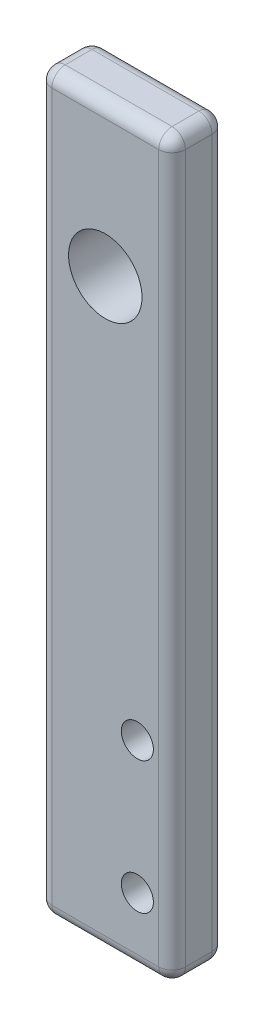
ISO-10303-21;
HEADER;
FILE_DESCRIPTION(('STEP AP214'),'2;1');
FILE_NAME('part.step','',(''),(''),'','','');
FILE_SCHEMA(('AUTOMOTIVE_DESIGN { 1 0 10303 214 1 1 1 1 }'));
ENDSEC;
DATA;
#1=APPLICATION_CONTEXT('core data for automotive mechanical design processes');
#2=APPLICATION_PROTOCOL_DEFINITION('international standard','automotive_design',2000,#1);
#3=PRODUCT_CONTEXT('',#1,'mechanical');
#4=PRODUCT('Part','Part','',(#3));
#5=PRODUCT_RELATED_PRODUCT_CATEGORY('part','',(#4));
#6=PRODUCT_DEFINITION_FORMATION('','',#4);
#7=PRODUCT_DEFINITION_CONTEXT('part definition',#1,'design');
#8=PRODUCT_DEFINITION('design','',#6,#7);
#9=PRODUCT_DEFINITION_SHAPE('','',#8);
#10=(LENGTH_UNIT() NAMED_UNIT(*) SI_UNIT(.MILLI.,.METRE.));
#11=(NAMED_UNIT(*) PLANE_ANGLE_UNIT() SI_UNIT($,.RADIAN.));
#12=(NAMED_UNIT(*) SI_UNIT($,.STERADIAN.) SOLID_ANGLE_UNIT());
#13=UNCERTAINTY_MEASURE_WITH_UNIT(LENGTH_MEASURE(1.E-05),#10,'distance_accuracy_value','');
#14=(GEOMETRIC_REPRESENTATION_CONTEXT(3) GLOBAL_UNCERTAINTY_ASSIGNED_CONTEXT((#13)) GLOBAL_UNIT_ASSIGNED_CONTEXT((#10,
#11,#12)) REPRESENTATION_CONTEXT('',''));
#15=CARTESIAN_POINT('',(0.,0.,0.));
#16=DIRECTION('',(0.,0.,1.));
#17=DIRECTION('',(1.,0.,0.));
#18=AXIS2_PLACEMENT_3D('',#15,#16,#17);
#19=CARTESIAN_POINT('',(0.,0.,4.));
#20=DIRECTION('',(0.,0.,-1.));
#21=DIRECTION('',(-1.,0.,0.));
#22=AXIS2_PLACEMENT_3D('',#19,#20,#21);
#23=PLANE('',#22);
#24=DIRECTION('',(0.,-1.,0.));
#25=VECTOR('',#24,1.);
#26=CARTESIAN_POINT('',(1.,0.,4.));
#27=LINE('',#26,#25);
#28=CARTESIAN_POINT('',(1.,54.,4.));
#29=VERTEX_POINT('',#28);
#30=CARTESIAN_POINT('',(1.,1.,4.));
#31=VERTEX_POINT('',#30);
#32=EDGE_CURVE('E144',#29,#31,#27,.T.);
#33=ORIENTED_EDGE('',*,*,#32,.T.);
#34=DIRECTION('',(1.,0.,0.));
#35=VECTOR('',#34,1.);
#36=CARTESIAN_POINT('',(0.,1.,4.));
#37=LINE('',#36,#35);
#38=CARTESIAN_POINT('',(9.,1.,4.));
#39=VERTEX_POINT('',#38);
#40=EDGE_CURVE('E139',#31,#39,#37,.T.);
#41=ORIENTED_EDGE('',*,*,#40,.T.);
#42=DIRECTION('',(0.,1.,0.));
#43=VECTOR('',#42,1.);
#44=CARTESIAN_POINT('',(9.,0.,4.));
#45=LINE('',#44,#43);
#46=CARTESIAN_POINT('',(9.,54.,4.));
#47=VERTEX_POINT('',#46);
#48=EDGE_CURVE('E133',#39,#47,#45,.T.);
#49=ORIENTED_EDGE('',*,*,#48,.T.);
#50=DIRECTION('',(-1.,0.,0.));
#51=VECTOR('',#50,1.);
#52=CARTESIAN_POINT('',(0.,54.,4.));
#53=LINE('',#52,#51);
#54=EDGE_CURVE('E136',#47,#29,#53,.T.);
#55=ORIENTED_EDGE('',*,*,#54,.T.);
#56=EDGE_LOOP('',(#33,#41,#49,#55));
#57=FACE_BOUND('',#56,.T.);
#58=CARTESIAN_POINT('',(7.3999999999983,4.99999999999631,4.));
#59=DIRECTION('',(0.,0.,1.));
#60=DIRECTION('',(1.,0.,0.));
#61=AXIS2_PLACEMENT_3D('',#58,#59,#60);
#62=CIRCLE('',#61,1.19999999998397);
#63=CARTESIAN_POINT('',(8.59999999998227,4.99999999999631,4.));
#64=VERTEX_POINT('',#63);
#65=EDGE_CURVE('E157',#64,#64,#62,.T.);
#66=ORIENTED_EDGE('',*,*,#65,.F.);
#67=EDGE_LOOP('',(#66));
#68=FACE_BOUND('',#67,.T.);
#69=CARTESIAN_POINT('',(7.39999999999826,14.8999999999963,4.));
#70=DIRECTION('',(0.,0.,1.));
#71=DIRECTION('',(1.,0.,0.));
#72=AXIS2_PLACEMENT_3D('',#69,#70,#71);
#73=CIRCLE('',#72,1.19999999998397);
#74=CARTESIAN_POINT('',(8.59999999998224,14.8999999999963,4.));
#75=VERTEX_POINT('',#74);
#76=EDGE_CURVE('E244',#75,#75,#73,.T.);
#77=ORIENTED_EDGE('',*,*,#76,.F.);
#78=EDGE_LOOP('',(#77));
#79=FACE_BOUND('',#78,.T.);
#80=CARTESIAN_POINT('',(5.00000000000172,43.7928786188915,4.));
#81=DIRECTION('',(0.,0.,1.));
#82=DIRECTION('',(1.,0.,0.));
#83=AXIS2_PLACEMENT_3D('',#80,#81,#82);
#84=CIRCLE('',#83,2.75);
#85=CARTESIAN_POINT('',(7.75000000000172,43.7928786188915,4.));
#86=VERTEX_POINT('',#85);
#87=EDGE_CURVE('E235',#86,#86,#84,.T.);
#88=ORIENTED_EDGE('',*,*,#87,.F.);
#89=EDGE_LOOP('',(#88));
#90=FACE_BOUND('',#89,.T.);
#91=ADVANCED_FACE('F40',(#57,#68,#79,#90),#23,.F.);
#92=CARTESIAN_POINT('',(0.,0.,0.));
#93=DIRECTION('',(0.,0.,-1.));
#94=DIRECTION('',(-1.,0.,0.));
#95=AXIS2_PLACEMENT_3D('',#92,#93,#94);
#96=PLANE('',#95);
#97=DIRECTION('',(0.,1.,0.));
#98=VECTOR('',#97,1.);
#99=CARTESIAN_POINT('',(9.,0.,0.));
#100=LINE('',#99,#98);
#101=CARTESIAN_POINT('',(9.,54.,0.));
#102=VERTEX_POINT('',#101);
#103=CARTESIAN_POINT('',(9.,1.,0.));
#104=VERTEX_POINT('',#103);
#105=EDGE_CURVE('E275',#102,#104,#100,.F.);
#106=ORIENTED_EDGE('',*,*,#105,.T.);
#107=DIRECTION('',(1.,0.,0.));
#108=VECTOR('',#107,1.);
#109=CARTESIAN_POINT('',(0.,1.,0.));
#110=LINE('',#109,#108);
#111=CARTESIAN_POINT('',(1.,1.,0.));
#112=VERTEX_POINT('',#111);
#113=EDGE_CURVE('E284',#104,#112,#110,.F.);
#114=ORIENTED_EDGE('',*,*,#113,.T.);
#115=DIRECTION('',(0.,-1.,0.));
#116=VECTOR('',#115,1.);
#117=CARTESIAN_POINT('',(1.,55.,0.));
#118=LINE('',#117,#116);
#119=CARTESIAN_POINT('',(1.,54.,0.));
#120=VERTEX_POINT('',#119);
#121=EDGE_CURVE('E281',#112,#120,#118,.F.);
#122=ORIENTED_EDGE('',*,*,#121,.T.);
#123=DIRECTION('',(-1.,0.,0.));
#124=VECTOR('',#123,1.);
#125=CARTESIAN_POINT('',(10.,54.,0.));
#126=LINE('',#125,#124);
#127=EDGE_CURVE('E278',#120,#102,#126,.F.);
#128=ORIENTED_EDGE('',*,*,#127,.T.);
#129=EDGE_LOOP('',(#106,#114,#122,#128));
#130=FACE_BOUND('',#129,.T.);
#131=CARTESIAN_POINT('',(7.39999999999826,14.8999999999963,0.));
#132=DIRECTION('',(0.,0.,1.));
#133=DIRECTION('',(1.,0.,0.));
#134=AXIS2_PLACEMENT_3D('',#131,#132,#133);
#135=CIRCLE('',#134,1.19999999998397);
#136=CARTESIAN_POINT('',(8.59999999998224,14.8999999999963,0.));
#137=VERTEX_POINT('',#136);
#138=EDGE_CURVE('E241',#137,#137,#135,.T.);
#139=ORIENTED_EDGE('',*,*,#138,.T.);
#140=EDGE_LOOP('',(#139));
#141=FACE_BOUND('',#140,.T.);
#142=CARTESIAN_POINT('',(7.3999999999983,4.99999999999631,0.));
#143=DIRECTION('',(0.,0.,1.));
#144=DIRECTION('',(1.,0.,0.));
#145=AXIS2_PLACEMENT_3D('',#142,#143,#144);
#146=CIRCLE('',#145,1.19999999998397);
#147=CARTESIAN_POINT('',(8.59999999998227,4.99999999999631,0.));
#148=VERTEX_POINT('',#147);
#149=EDGE_CURVE('E248',#148,#148,#146,.T.);
#150=ORIENTED_EDGE('',*,*,#149,.T.);
#151=EDGE_LOOP('',(#150));
#152=FACE_BOUND('',#151,.T.);
#153=CARTESIAN_POINT('',(5.00000000000172,43.7928786188915,0.));
#154=DIRECTION('',(0.,0.,1.));
#155=DIRECTION('',(1.,0.,0.));
#156=AXIS2_PLACEMENT_3D('',#153,#154,#155);
#157=CIRCLE('',#156,2.75);
#158=CARTESIAN_POINT('',(7.75000000000172,43.7928786188915,0.));
#159=VERTEX_POINT('',#158);
#160=EDGE_CURVE('E229',#159,#159,#157,.T.);
#161=ORIENTED_EDGE('',*,*,#160,.T.);
#162=EDGE_LOOP('',(#161));
#163=FACE_BOUND('',#162,.T.);
#164=ADVANCED_FACE('F410',(#130,#141,#152,#163),#96,.T.);
#165=CARTESIAN_POINT('',(0.,0.,4.));
#166=DIRECTION('',(1.,0.,0.));
#167=DIRECTION('',(0.,0.,-1.));
#168=AXIS2_PLACEMENT_3D('',#165,#166,#167);
#169=PLANE('',#168);
#170=DIRECTION('',(0.,0.,-1.));
#171=VECTOR('',#170,1.);
#172=CARTESIAN_POINT('',(0.,54.,4.));
#173=LINE('',#172,#171);
#174=CARTESIAN_POINT('',(0.,54.,3.));
#175=VERTEX_POINT('',#174);
#176=CARTESIAN_POINT('',(0.,54.,1.));
#177=VERTEX_POINT('',#176);
#178=EDGE_CURVE('E291',#175,#177,#173,.T.);
#179=ORIENTED_EDGE('',*,*,#178,.T.);
#180=DIRECTION('',(0.,-1.,0.));
#181=VECTOR('',#180,1.);
#182=CARTESIAN_POINT('',(0.,0.,1.));
#183=LINE('',#182,#181);
#184=CARTESIAN_POINT('',(0.,1.,1.));
#185=VERTEX_POINT('',#184);
#186=EDGE_CURVE('E298',#177,#185,#183,.T.);
#187=ORIENTED_EDGE('',*,*,#186,.T.);
#188=DIRECTION('',(0.,0.,-1.));
#189=VECTOR('',#188,1.);
#190=CARTESIAN_POINT('',(0.,1.,4.));
#191=LINE('',#190,#189);
#192=CARTESIAN_POINT('',(0.,1.,3.));
#193=VERTEX_POINT('',#192);
#194=EDGE_CURVE('E294',#185,#193,#191,.F.);
#195=ORIENTED_EDGE('',*,*,#194,.T.);
#196=DIRECTION('',(0.,-1.,0.));
#197=VECTOR('',#196,1.);
#198=CARTESIAN_POINT('',(0.,0.,3.));
#199=LINE('',#198,#197);
#200=EDGE_CURVE('E288',#193,#175,#199,.F.);
#201=ORIENTED_EDGE('',*,*,#200,.T.);
#202=EDGE_LOOP('',(#179,#187,#195,#201));
#203=FACE_BOUND('',#202,.T.);
#204=ADVANCED_FACE('F381',(#203),#169,.F.);
#205=CARTESIAN_POINT('',(0.,0.,4.));
#206=DIRECTION('',(0.,1.,0.));
#207=DIRECTION('',(0.,0.,1.));
#208=AXIS2_PLACEMENT_3D('',#205,#206,#207);
#209=PLANE('',#208);
#210=DIRECTION('',(1.,0.,0.));
#211=VECTOR('',#210,1.);
#212=CARTESIAN_POINT('',(0.,0.,3.));
#213=LINE('',#212,#211);
#214=CARTESIAN_POINT('',(9.,0.,3.));
#215=VERTEX_POINT('',#214);
#216=CARTESIAN_POINT('',(1.,0.,3.));
#217=VERTEX_POINT('',#216);
#218=EDGE_CURVE('E268',#215,#217,#213,.F.);
#219=ORIENTED_EDGE('',*,*,#218,.T.);
#220=DIRECTION('',(0.,0.,-1.));
#221=VECTOR('',#220,1.);
#222=CARTESIAN_POINT('',(1.,0.,4.));
#223=LINE('',#222,#221);
#224=CARTESIAN_POINT('',(1.,0.,1.));
#225=VERTEX_POINT('',#224);
#226=EDGE_CURVE('E272',#217,#225,#223,.T.);
#227=ORIENTED_EDGE('',*,*,#226,.T.);
#228=DIRECTION('',(1.,0.,0.));
#229=VECTOR('',#228,1.);
#230=CARTESIAN_POINT('',(10.,0.,1.));
#231=LINE('',#230,#229);
#232=CARTESIAN_POINT('',(9.,0.,1.));
#233=VERTEX_POINT('',#232);
#234=EDGE_CURVE('E265',#225,#233,#231,.T.);
#235=ORIENTED_EDGE('',*,*,#234,.T.);
#236=DIRECTION('',(0.,0.,-1.));
#237=VECTOR('',#236,1.);
#238=CARTESIAN_POINT('',(9.,0.,4.));
#239=LINE('',#238,#237);
#240=EDGE_CURVE('E262',#233,#215,#239,.F.);
#241=ORIENTED_EDGE('',*,*,#240,.T.);
#242=EDGE_LOOP('',(#219,#227,#235,#241));
#243=FACE_BOUND('',#242,.T.);
#244=ADVANCED_FACE('F353',(#243),#209,.F.);
#245=CARTESIAN_POINT('',(10.,0.,4.));
#246=DIRECTION('',(-1.,0.,0.));
#247=DIRECTION('',(0.,0.,1.));
#248=AXIS2_PLACEMENT_3D('',#245,#246,#247);
#249=PLANE('',#248);
#250=DIRECTION('',(0.,0.,-1.));
#251=VECTOR('',#250,1.);
#252=CARTESIAN_POINT('',(10.,1.,4.));
#253=LINE('',#252,#251);
#254=CARTESIAN_POINT('',(10.,1.,3.));
#255=VERTEX_POINT('',#254);
#256=CARTESIAN_POINT('',(10.,1.,1.));
#257=VERTEX_POINT('',#256);
#258=EDGE_CURVE('E306',#255,#257,#253,.T.);
#259=ORIENTED_EDGE('',*,*,#258,.T.);
#260=DIRECTION('',(0.,1.,0.));
#261=VECTOR('',#260,1.);
#262=CARTESIAN_POINT('',(10.,55.,1.));
#263=LINE('',#262,#261);
#264=CARTESIAN_POINT('',(10.,54.,1.));
#265=VERTEX_POINT('',#264);
#266=EDGE_CURVE('E310',#257,#265,#263,.T.);
#267=ORIENTED_EDGE('',*,*,#266,.T.);
#268=DIRECTION('',(0.,0.,-1.));
#269=VECTOR('',#268,1.);
#270=CARTESIAN_POINT('',(10.,54.,4.));
#271=LINE('',#270,#269);
#272=CARTESIAN_POINT('',(10.,54.,3.));
#273=VERTEX_POINT('',#272);
#274=EDGE_CURVE('E303',#265,#273,#271,.F.);
#275=ORIENTED_EDGE('',*,*,#274,.T.);
#276=DIRECTION('',(0.,1.,0.));
#277=VECTOR('',#276,1.);
#278=CARTESIAN_POINT('',(10.,0.,3.));
#279=LINE('',#278,#277);
#280=EDGE_CURVE('E169',#273,#255,#279,.F.);
#281=ORIENTED_EDGE('',*,*,#280,.T.);
#282=EDGE_LOOP('',(#259,#267,#275,#281));
#283=FACE_BOUND('',#282,.T.);
#284=ADVANCED_FACE('F366',(#283),#249,.F.);
#285=CARTESIAN_POINT('',(0.,55.,4.));
#286=DIRECTION('',(0.,-1.,0.));
#287=DIRECTION('',(0.,0.,-1.));
#288=AXIS2_PLACEMENT_3D('',#285,#286,#287);
#289=PLANE('',#288);
#290=DIRECTION('',(0.,0.,-1.));
#291=VECTOR('',#290,1.);
#292=CARTESIAN_POINT('',(9.,55.,4.));
#293=LINE('',#292,#291);
#294=CARTESIAN_POINT('',(9.,55.,3.));
#295=VERTEX_POINT('',#294);
#296=CARTESIAN_POINT('',(9.,55.,1.));
#297=VERTEX_POINT('',#296);
#298=EDGE_CURVE('E50',#295,#297,#293,.T.);
#299=ORIENTED_EDGE('',*,*,#298,.T.);
#300=DIRECTION('',(-1.,0.,0.));
#301=VECTOR('',#300,1.);
#302=CARTESIAN_POINT('',(0.,55.,1.));
#303=LINE('',#302,#301);
#304=CARTESIAN_POINT('',(1.,55.,1.));
#305=VERTEX_POINT('',#304);
#306=EDGE_CURVE('E11',#297,#305,#303,.T.);
#307=ORIENTED_EDGE('',*,*,#306,.T.);
#308=DIRECTION('',(0.,0.,-1.));
#309=VECTOR('',#308,1.);
#310=CARTESIAN_POINT('',(1.,55.,4.));
#311=LINE('',#310,#309);
#312=CARTESIAN_POINT('',(1.,55.,3.));
#313=VERTEX_POINT('',#312);
#314=EDGE_CURVE('E316',#305,#313,#311,.F.);
#315=ORIENTED_EDGE('',*,*,#314,.T.);
#316=DIRECTION('',(-1.,0.,0.));
#317=VECTOR('',#316,1.);
#318=CARTESIAN_POINT('',(0.,55.,3.));
#319=LINE('',#318,#317);
#320=EDGE_CURVE('E313',#313,#295,#319,.F.);
#321=ORIENTED_EDGE('',*,*,#320,.T.);
#322=EDGE_LOOP('',(#299,#307,#315,#321));
#323=FACE_BOUND('',#322,.T.);
#324=ADVANCED_FACE('F369',(#323),#289,.F.);
#325=CARTESIAN_POINT('',(7.3999999999983,4.99999999999631,4.));
#326=DIRECTION('',(0.,0.,-1.));
#327=DIRECTION('',(-1.,0.,0.));
#328=AXIS2_PLACEMENT_3D('',#325,#326,#327);
#329=CYLINDRICAL_SURFACE('',#328,1.19999999998397);
#330=ORIENTED_EDGE('',*,*,#65,.T.);
#331=EDGE_LOOP('',(#330));
#332=FACE_BOUND('',#331,.T.);
#333=ORIENTED_EDGE('',*,*,#149,.F.);
#334=EDGE_LOOP('',(#333));
#335=FACE_BOUND('',#334,.T.);
#336=ADVANCED_FACE('F419',(#332,#335),#329,.F.);
#337=CARTESIAN_POINT('',(7.39999999999826,14.8999999999963,4.));
#338=DIRECTION('',(0.,0.,-1.));
#339=DIRECTION('',(-1.,0.,0.));
#340=AXIS2_PLACEMENT_3D('',#337,#338,#339);
#341=CYLINDRICAL_SURFACE('',#340,1.19999999998397);
#342=ORIENTED_EDGE('',*,*,#76,.T.);
#343=EDGE_LOOP('',(#342));
#344=FACE_BOUND('',#343,.T.);
#345=ORIENTED_EDGE('',*,*,#138,.F.);
#346=EDGE_LOOP('',(#345));
#347=FACE_BOUND('',#346,.T.);
#348=ADVANCED_FACE('F585',(#344,#347),#341,.F.);
#349=CARTESIAN_POINT('',(5.00000000000172,43.7928786188915,4.));
#350=DIRECTION('',(0.,0.,-1.));
#351=DIRECTION('',(-1.,0.,0.));
#352=AXIS2_PLACEMENT_3D('',#349,#350,#351);
#353=CYLINDRICAL_SURFACE('',#352,2.75);
#354=ORIENTED_EDGE('',*,*,#87,.T.);
#355=EDGE_LOOP('',(#354));
#356=FACE_BOUND('',#355,.T.);
#357=ORIENTED_EDGE('',*,*,#160,.F.);
#358=EDGE_LOOP('',(#357));
#359=FACE_BOUND('',#358,.T.);
#360=ADVANCED_FACE('F578',(#356,#359),#353,.F.);
#361=CARTESIAN_POINT('',(0.,54.,1.));
#362=DIRECTION('',(1.,0.,0.));
#363=DIRECTION('',(0.,0.,-1.));
#364=AXIS2_PLACEMENT_3D('',#361,#362,#363);
#365=CYLINDRICAL_SURFACE('',#364,1.);
#366=CARTESIAN_POINT('',(1.,54.,1.));
#367=DIRECTION('',(-1.,0.,0.));
#368=DIRECTION('',(0.,0.,1.));
#369=AXIS2_PLACEMENT_3D('',#366,#367,#368);
#370=CIRCLE('',#369,1.);
#371=EDGE_CURVE('E44',#305,#120,#370,.T.);
#372=ORIENTED_EDGE('',*,*,#371,.F.);
#373=ORIENTED_EDGE('',*,*,#306,.F.);
#374=CARTESIAN_POINT('',(9.,54.,1.));
#375=DIRECTION('',(1.,0.,0.));
#376=DIRECTION('',(0.,0.,-1.));
#377=AXIS2_PLACEMENT_3D('',#374,#375,#376);
#378=CIRCLE('',#377,1.);
#379=EDGE_CURVE('E222',#102,#297,#378,.T.);
#380=ORIENTED_EDGE('',*,*,#379,.F.);
#381=ORIENTED_EDGE('',*,*,#127,.F.);
#382=EDGE_LOOP('',(#372,#373,#380,#381));
#383=FACE_BOUND('',#382,.T.);
#384=ADVANCED_FACE('F42',(#383),#365,.T.);
#385=CARTESIAN_POINT('',(1.,54.,1.));
#386=DIRECTION('',(0.,0.,1.));
#387=DIRECTION('',(1.,0.,0.));
#388=AXIS2_PLACEMENT_3D('',#385,#386,#387);
#389=SPHERICAL_SURFACE('',#388,1.);
#390=CARTESIAN_POINT('',(1.,54.,1.));
#391=DIRECTION('',(0.,0.,-1.));
#392=DIRECTION('',(-1.,0.,0.));
#393=AXIS2_PLACEMENT_3D('',#390,#391,#392);
#394=CIRCLE('',#393,1.);
#395=EDGE_CURVE('E215',#305,#177,#394,.F.);
#396=ORIENTED_EDGE('',*,*,#395,.F.);
#397=ORIENTED_EDGE('',*,*,#371,.T.);
#398=CARTESIAN_POINT('',(1.,54.,1.));
#399=DIRECTION('',(0.,1.,0.));
#400=DIRECTION('',(0.,0.,1.));
#401=AXIS2_PLACEMENT_3D('',#398,#399,#400);
#402=CIRCLE('',#401,1.);
#403=EDGE_CURVE('E219',#177,#120,#402,.F.);
#404=ORIENTED_EDGE('',*,*,#403,.F.);
#405=EDGE_LOOP('',(#396,#397,#404));
#406=FACE_BOUND('',#405,.T.);
#407=ADVANCED_FACE('F402',(#406),#389,.T.);
#408=CARTESIAN_POINT('',(9.,54.,1.));
#409=DIRECTION('',(0.,0.,1.));
#410=DIRECTION('',(1.,0.,0.));
#411=AXIS2_PLACEMENT_3D('',#408,#409,#410);
#412=SPHERICAL_SURFACE('',#411,1.);
#413=CARTESIAN_POINT('',(9.,54.,1.));
#414=DIRECTION('',(0.,1.,0.));
#415=DIRECTION('',(0.,0.,1.));
#416=AXIS2_PLACEMENT_3D('',#413,#414,#415);
#417=CIRCLE('',#416,1.);
#418=EDGE_CURVE('E209',#102,#265,#417,.F.);
#419=ORIENTED_EDGE('',*,*,#418,.F.);
#420=ORIENTED_EDGE('',*,*,#379,.T.);
#421=CARTESIAN_POINT('',(9.,54.,1.));
#422=DIRECTION('',(0.,0.,-1.));
#423=DIRECTION('',(-1.,0.,0.));
#424=AXIS2_PLACEMENT_3D('',#421,#422,#423);
#425=CIRCLE('',#424,1.);
#426=EDGE_CURVE('E58',#265,#297,#425,.F.);
#427=ORIENTED_EDGE('',*,*,#426,.F.);
#428=EDGE_LOOP('',(#419,#420,#427));
#429=FACE_BOUND('',#428,.T.);
#430=ADVANCED_FACE('F400',(#429),#412,.T.);
#431=CARTESIAN_POINT('',(1.,0.,1.));
#432=DIRECTION('',(0.,1.,0.));
#433=DIRECTION('',(0.,0.,1.));
#434=AXIS2_PLACEMENT_3D('',#431,#432,#433);
#435=CYLINDRICAL_SURFACE('',#434,1.);
#436=ORIENTED_EDGE('',*,*,#403,.T.);
#437=ORIENTED_EDGE('',*,*,#121,.F.);
#438=CARTESIAN_POINT('',(1.,1.,1.));
#439=DIRECTION('',(0.,-1.,0.));
#440=DIRECTION('',(0.,0.,-1.));
#441=AXIS2_PLACEMENT_3D('',#438,#439,#440);
#442=CIRCLE('',#441,1.);
#443=EDGE_CURVE('E202',#185,#112,#442,.T.);
#444=ORIENTED_EDGE('',*,*,#443,.F.);
#445=ORIENTED_EDGE('',*,*,#186,.F.);
#446=EDGE_LOOP('',(#436,#437,#444,#445));
#447=FACE_BOUND('',#446,.T.);
#448=ADVANCED_FACE('F386',(#447),#435,.T.);
#449=CARTESIAN_POINT('',(1.,54.,4.));
#450=DIRECTION('',(0.,0.,-1.));
#451=DIRECTION('',(-1.,0.,0.));
#452=AXIS2_PLACEMENT_3D('',#449,#450,#451);
#453=CYLINDRICAL_SURFACE('',#452,1.);
#454=ORIENTED_EDGE('',*,*,#395,.T.);
#455=ORIENTED_EDGE('',*,*,#178,.F.);
#456=CARTESIAN_POINT('',(1.,54.,3.));
#457=DIRECTION('',(0.,0.,1.));
#458=DIRECTION('',(1.,0.,0.));
#459=AXIS2_PLACEMENT_3D('',#456,#457,#458);
#460=CIRCLE('',#459,1.);
#461=EDGE_CURVE('E198',#313,#175,#460,.T.);
#462=ORIENTED_EDGE('',*,*,#461,.F.);
#463=ORIENTED_EDGE('',*,*,#314,.F.);
#464=EDGE_LOOP('',(#454,#455,#462,#463));
#465=FACE_BOUND('',#464,.T.);
#466=ADVANCED_FACE('F374',(#465),#453,.T.);
#467=CARTESIAN_POINT('',(0.,54.,3.));
#468=DIRECTION('',(-1.,0.,0.));
#469=DIRECTION('',(0.,0.,1.));
#470=AXIS2_PLACEMENT_3D('',#467,#468,#469);
#471=CYLINDRICAL_SURFACE('',#470,1.);
#472=CARTESIAN_POINT('',(9.,54.,3.));
#473=DIRECTION('',(1.,0.,0.));
#474=DIRECTION('',(0.,0.,-1.));
#475=AXIS2_PLACEMENT_3D('',#472,#473,#474);
#476=CIRCLE('',#475,1.);
#477=EDGE_CURVE('E151',#295,#47,#476,.T.);
#478=ORIENTED_EDGE('',*,*,#477,.F.);
#479=ORIENTED_EDGE('',*,*,#320,.F.);
#480=CARTESIAN_POINT('',(1.,54.,3.));
#481=DIRECTION('',(-1.,0.,0.));
#482=DIRECTION('',(0.,0.,1.));
#483=AXIS2_PLACEMENT_3D('',#480,#481,#482);
#484=CIRCLE('',#483,1.);
#485=EDGE_CURVE('E154',#29,#313,#484,.T.);
#486=ORIENTED_EDGE('',*,*,#485,.F.);
#487=ORIENTED_EDGE('',*,*,#54,.F.);
#488=EDGE_LOOP('',(#478,#479,#486,#487));
#489=FACE_BOUND('',#488,.T.);
#490=ADVANCED_FACE('F149',(#489),#471,.T.);
#491=CARTESIAN_POINT('',(9.,54.,4.));
#492=DIRECTION('',(0.,0.,-1.));
#493=DIRECTION('',(-1.,0.,0.));
#494=AXIS2_PLACEMENT_3D('',#491,#492,#493);
#495=CYLINDRICAL_SURFACE('',#494,1.);
#496=ORIENTED_EDGE('',*,*,#426,.T.);
#497=ORIENTED_EDGE('',*,*,#298,.F.);
#498=CARTESIAN_POINT('',(9.,54.,3.));
#499=DIRECTION('',(0.,0.,1.));
#500=DIRECTION('',(1.,0.,0.));
#501=AXIS2_PLACEMENT_3D('',#498,#499,#500);
#502=CIRCLE('',#501,1.);
#503=EDGE_CURVE('E165',#273,#295,#502,.T.);
#504=ORIENTED_EDGE('',*,*,#503,.F.);
#505=ORIENTED_EDGE('',*,*,#274,.F.);
#506=EDGE_LOOP('',(#496,#497,#504,#505));
#507=FACE_BOUND('',#506,.T.);
#508=ADVANCED_FACE('F368',(#507),#495,.T.);
#509=CARTESIAN_POINT('',(9.,0.,1.));
#510=DIRECTION('',(0.,-1.,0.));
#511=DIRECTION('',(0.,0.,-1.));
#512=AXIS2_PLACEMENT_3D('',#509,#510,#511);
#513=CYLINDRICAL_SURFACE('',#512,1.);
#514=ORIENTED_EDGE('',*,*,#418,.T.);
#515=ORIENTED_EDGE('',*,*,#266,.F.);
#516=CARTESIAN_POINT('',(9.,1.,1.));
#517=DIRECTION('',(0.,-1.,0.));
#518=DIRECTION('',(0.,0.,-1.));
#519=AXIS2_PLACEMENT_3D('',#516,#517,#518);
#520=CIRCLE('',#519,1.);
#521=EDGE_CURVE('E190',#104,#257,#520,.T.);
#522=ORIENTED_EDGE('',*,*,#521,.F.);
#523=ORIENTED_EDGE('',*,*,#105,.F.);
#524=EDGE_LOOP('',(#514,#515,#522,#523));
#525=FACE_BOUND('',#524,.T.);
#526=ADVANCED_FACE('F399',(#525),#513,.T.);
#527=CARTESIAN_POINT('',(0.,1.,1.));
#528=DIRECTION('',(-1.,0.,0.));
#529=DIRECTION('',(0.,0.,1.));
#530=AXIS2_PLACEMENT_3D('',#527,#528,#529);
#531=CYLINDRICAL_SURFACE('',#530,1.);
#532=CARTESIAN_POINT('',(1.,1.,1.));
#533=DIRECTION('',(-1.,0.,0.));
#534=DIRECTION('',(0.,0.,1.));
#535=AXIS2_PLACEMENT_3D('',#532,#533,#534);
#536=CIRCLE('',#535,1.);
#537=EDGE_CURVE('E205',#112,#225,#536,.T.);
#538=ORIENTED_EDGE('',*,*,#537,.F.);
#539=ORIENTED_EDGE('',*,*,#113,.F.);
#540=CARTESIAN_POINT('',(9.,1.,1.));
#541=DIRECTION('',(1.,0.,0.));
#542=DIRECTION('',(0.,0.,-1.));
#543=AXIS2_PLACEMENT_3D('',#540,#541,#542);
#544=CIRCLE('',#543,1.);
#545=EDGE_CURVE('E186',#233,#104,#544,.T.);
#546=ORIENTED_EDGE('',*,*,#545,.F.);
#547=ORIENTED_EDGE('',*,*,#234,.F.);
#548=EDGE_LOOP('',(#538,#539,#546,#547));
#549=FACE_BOUND('',#548,.T.);
#550=ADVANCED_FACE('F392',(#549),#531,.T.);
#551=CARTESIAN_POINT('',(1.,1.,1.));
#552=DIRECTION('',(0.,0.,1.));
#553=DIRECTION('',(1.,0.,0.));
#554=AXIS2_PLACEMENT_3D('',#551,#552,#553);
#555=SPHERICAL_SURFACE('',#554,1.);
#556=ORIENTED_EDGE('',*,*,#443,.T.);
#557=ORIENTED_EDGE('',*,*,#537,.T.);
#558=CARTESIAN_POINT('',(1.,1.,1.));
#559=DIRECTION('',(0.,0.,-1.));
#560=DIRECTION('',(-1.,0.,0.));
#561=AXIS2_PLACEMENT_3D('',#558,#559,#560);
#562=CIRCLE('',#561,1.);
#563=EDGE_CURVE('E177',#185,#225,#562,.F.);
#564=ORIENTED_EDGE('',*,*,#563,.F.);
#565=EDGE_LOOP('',(#556,#557,#564));
#566=FACE_BOUND('',#565,.T.);
#567=ADVANCED_FACE('F389',(#566),#555,.T.);
#568=CARTESIAN_POINT('',(1.,54.,3.));
#569=DIRECTION('',(0.,0.,1.));
#570=DIRECTION('',(1.,0.,0.));
#571=AXIS2_PLACEMENT_3D('',#568,#569,#570);
#572=SPHERICAL_SURFACE('',#571,1.);
#573=ORIENTED_EDGE('',*,*,#485,.T.);
#574=ORIENTED_EDGE('',*,*,#461,.T.);
#575=CARTESIAN_POINT('',(1.,54.,3.));
#576=DIRECTION('',(0.,1.,0.));
#577=DIRECTION('',(0.,0.,1.));
#578=AXIS2_PLACEMENT_3D('',#575,#576,#577);
#579=CIRCLE('',#578,1.);
#580=EDGE_CURVE('E171',#29,#175,#579,.F.);
#581=ORIENTED_EDGE('',*,*,#580,.F.);
#582=EDGE_LOOP('',(#573,#574,#581));
#583=FACE_BOUND('',#582,.T.);
#584=ADVANCED_FACE('F376',(#583),#572,.T.);
#585=CARTESIAN_POINT('',(9.,54.,3.));
#586=DIRECTION('',(0.,0.,1.));
#587=DIRECTION('',(1.,0.,0.));
#588=AXIS2_PLACEMENT_3D('',#585,#586,#587);
#589=SPHERICAL_SURFACE('',#588,1.);
#590=ORIENTED_EDGE('',*,*,#503,.T.);
#591=ORIENTED_EDGE('',*,*,#477,.T.);
#592=CARTESIAN_POINT('',(9.,54.,3.));
#593=DIRECTION('',(0.,1.,0.));
#594=DIRECTION('',(0.,0.,1.));
#595=AXIS2_PLACEMENT_3D('',#592,#593,#594);
#596=CIRCLE('',#595,1.);
#597=EDGE_CURVE('E162',#273,#47,#596,.F.);
#598=ORIENTED_EDGE('',*,*,#597,.F.);
#599=EDGE_LOOP('',(#590,#591,#598));
#600=FACE_BOUND('',#599,.T.);
#601=ADVANCED_FACE('F161',(#600),#589,.T.);
#602=CARTESIAN_POINT('',(9.,1.,1.));
#603=DIRECTION('',(0.,0.,1.));
#604=DIRECTION('',(1.,0.,0.));
#605=AXIS2_PLACEMENT_3D('',#602,#603,#604);
#606=SPHERICAL_SURFACE('',#605,1.);
#607=ORIENTED_EDGE('',*,*,#545,.T.);
#608=ORIENTED_EDGE('',*,*,#521,.T.);
#609=CARTESIAN_POINT('',(9.,1.,1.));
#610=DIRECTION('',(0.,0.,-1.));
#611=DIRECTION('',(-1.,0.,0.));
#612=AXIS2_PLACEMENT_3D('',#609,#610,#611);
#613=CIRCLE('',#612,1.);
#614=EDGE_CURVE('E172',#233,#257,#613,.F.);
#615=ORIENTED_EDGE('',*,*,#614,.F.);
#616=EDGE_LOOP('',(#607,#608,#615));
#617=FACE_BOUND('',#616,.T.);
#618=ADVANCED_FACE('F396',(#617),#606,.T.);
#619=CARTESIAN_POINT('',(1.,1.,4.));
#620=DIRECTION('',(0.,0.,-1.));
#621=DIRECTION('',(-1.,0.,0.));
#622=AXIS2_PLACEMENT_3D('',#619,#620,#621);
#623=CYLINDRICAL_SURFACE('',#622,1.);
#624=ORIENTED_EDGE('',*,*,#563,.T.);
#625=ORIENTED_EDGE('',*,*,#226,.F.);
#626=CARTESIAN_POINT('',(1.,1.,3.));
#627=DIRECTION('',(0.,0.,1.));
#628=DIRECTION('',(1.,0.,0.));
#629=AXIS2_PLACEMENT_3D('',#626,#627,#628);
#630=CIRCLE('',#629,1.);
#631=EDGE_CURVE('E179',#193,#217,#630,.T.);
#632=ORIENTED_EDGE('',*,*,#631,.F.);
#633=ORIENTED_EDGE('',*,*,#194,.F.);
#634=EDGE_LOOP('',(#624,#625,#632,#633));
#635=FACE_BOUND('',#634,.T.);
#636=ADVANCED_FACE('F348',(#635),#623,.T.);
#637=CARTESIAN_POINT('',(1.,0.,3.));
#638=DIRECTION('',(0.,-1.,0.));
#639=DIRECTION('',(0.,0.,-1.));
#640=AXIS2_PLACEMENT_3D('',#637,#638,#639);
#641=CYLINDRICAL_SURFACE('',#640,1.);
#642=ORIENTED_EDGE('',*,*,#580,.T.);
#643=ORIENTED_EDGE('',*,*,#200,.F.);
#644=CARTESIAN_POINT('',(1.,1.,3.));
#645=DIRECTION('',(0.,-1.,0.));
#646=DIRECTION('',(0.,0.,-1.));
#647=AXIS2_PLACEMENT_3D('',#644,#645,#646);
#648=CIRCLE('',#647,1.);
#649=EDGE_CURVE('E335',#31,#193,#648,.T.);
#650=ORIENTED_EDGE('',*,*,#649,.F.);
#651=ORIENTED_EDGE('',*,*,#32,.F.);
#652=EDGE_LOOP('',(#642,#643,#650,#651));
#653=FACE_BOUND('',#652,.T.);
#654=ADVANCED_FACE('F379',(#653),#641,.T.);
#655=CARTESIAN_POINT('',(9.,0.,3.));
#656=DIRECTION('',(0.,1.,0.));
#657=DIRECTION('',(0.,0.,1.));
#658=AXIS2_PLACEMENT_3D('',#655,#656,#657);
#659=CYLINDRICAL_SURFACE('',#658,1.);
#660=ORIENTED_EDGE('',*,*,#597,.T.);
#661=ORIENTED_EDGE('',*,*,#48,.F.);
#662=CARTESIAN_POINT('',(9.,1.,3.));
#663=DIRECTION('',(0.,-1.,0.));
#664=DIRECTION('',(0.,0.,-1.));
#665=AXIS2_PLACEMENT_3D('',#662,#663,#664);
#666=CIRCLE('',#665,1.);
#667=EDGE_CURVE('E331',#255,#39,#666,.T.);
#668=ORIENTED_EDGE('',*,*,#667,.F.);
#669=ORIENTED_EDGE('',*,*,#280,.F.);
#670=EDGE_LOOP('',(#660,#661,#668,#669));
#671=FACE_BOUND('',#670,.T.);
#672=ADVANCED_FACE('F168',(#671),#659,.T.);
#673=CARTESIAN_POINT('',(9.,1.,4.));
#674=DIRECTION('',(0.,0.,-1.));
#675=DIRECTION('',(-1.,0.,0.));
#676=AXIS2_PLACEMENT_3D('',#673,#674,#675);
#677=CYLINDRICAL_SURFACE('',#676,1.);
#678=ORIENTED_EDGE('',*,*,#614,.T.);
#679=ORIENTED_EDGE('',*,*,#258,.F.);
#680=CARTESIAN_POINT('',(9.,1.,3.));
#681=DIRECTION('',(0.,0.,1.));
#682=DIRECTION('',(1.,0.,0.));
#683=AXIS2_PLACEMENT_3D('',#680,#681,#682);
#684=CIRCLE('',#683,1.);
#685=EDGE_CURVE('E327',#215,#255,#684,.T.);
#686=ORIENTED_EDGE('',*,*,#685,.F.);
#687=ORIENTED_EDGE('',*,*,#240,.F.);
#688=EDGE_LOOP('',(#678,#679,#686,#687));
#689=FACE_BOUND('',#688,.T.);
#690=ADVANCED_FACE('F363',(#689),#677,.T.);
#691=CARTESIAN_POINT('',(1.,1.,3.));
#692=DIRECTION('',(0.,0.,1.));
#693=DIRECTION('',(1.,0.,0.));
#694=AXIS2_PLACEMENT_3D('',#691,#692,#693);
#695=SPHERICAL_SURFACE('',#694,1.);
#696=ORIENTED_EDGE('',*,*,#649,.T.);
#697=ORIENTED_EDGE('',*,*,#631,.T.);
#698=CARTESIAN_POINT('',(1.,1.,3.));
#699=DIRECTION('',(-1.,0.,0.));
#700=DIRECTION('',(0.,0.,1.));
#701=AXIS2_PLACEMENT_3D('',#698,#699,#700);
#702=CIRCLE('',#701,1.);
#703=EDGE_CURVE('E324',#31,#217,#702,.F.);
#704=ORIENTED_EDGE('',*,*,#703,.F.);
#705=EDGE_LOOP('',(#696,#697,#704));
#706=FACE_BOUND('',#705,.T.);
#707=ADVANCED_FACE('F343',(#706),#695,.T.);
#708=CARTESIAN_POINT('',(9.,1.,3.));
#709=DIRECTION('',(0.,0.,1.));
#710=DIRECTION('',(1.,0.,0.));
#711=AXIS2_PLACEMENT_3D('',#708,#709,#710);
#712=SPHERICAL_SURFACE('',#711,1.);
#713=ORIENTED_EDGE('',*,*,#685,.T.);
#714=ORIENTED_EDGE('',*,*,#667,.T.);
#715=CARTESIAN_POINT('',(9.,1.,3.));
#716=DIRECTION('',(1.,0.,0.));
#717=DIRECTION('',(0.,0.,-1.));
#718=AXIS2_PLACEMENT_3D('',#715,#716,#717);
#719=CIRCLE('',#718,1.);
#720=EDGE_CURVE('E321',#215,#39,#719,.F.);
#721=ORIENTED_EDGE('',*,*,#720,.F.);
#722=EDGE_LOOP('',(#713,#714,#721));
#723=FACE_BOUND('',#722,.T.);
#724=ADVANCED_FACE('F360',(#723),#712,.T.);
#725=CARTESIAN_POINT('',(0.,1.,3.));
#726=DIRECTION('',(1.,0.,0.));
#727=DIRECTION('',(0.,0.,-1.));
#728=AXIS2_PLACEMENT_3D('',#725,#726,#727);
#729=CYLINDRICAL_SURFACE('',#728,1.);
#730=ORIENTED_EDGE('',*,*,#703,.T.);
#731=ORIENTED_EDGE('',*,*,#218,.F.);
#732=ORIENTED_EDGE('',*,*,#720,.T.);
#733=ORIENTED_EDGE('',*,*,#40,.F.);
#734=EDGE_LOOP('',(#730,#731,#732,#733));
#735=FACE_BOUND('',#734,.T.);
#736=ADVANCED_FACE('F358',(#735),#729,.T.);
#737=CLOSED_SHELL('',(#91,#164,#204,#244,#284,#324,#336,#348,#360,#384,#407,#430,#448,#466,#490,
#508,#526,#550,#567,#584,#601,#618,#636,#654,#672,#690,#707,#724,#736));
#738=MANIFOLD_SOLID_BREP('B2',#737);
#739=ADVANCED_BREP_SHAPE_REPRESENTATION('',(#18,#738),#14);
#740=SHAPE_DEFINITION_REPRESENTATION(#9,#739);
ENDSEC;
END-ISO-10303-21;
